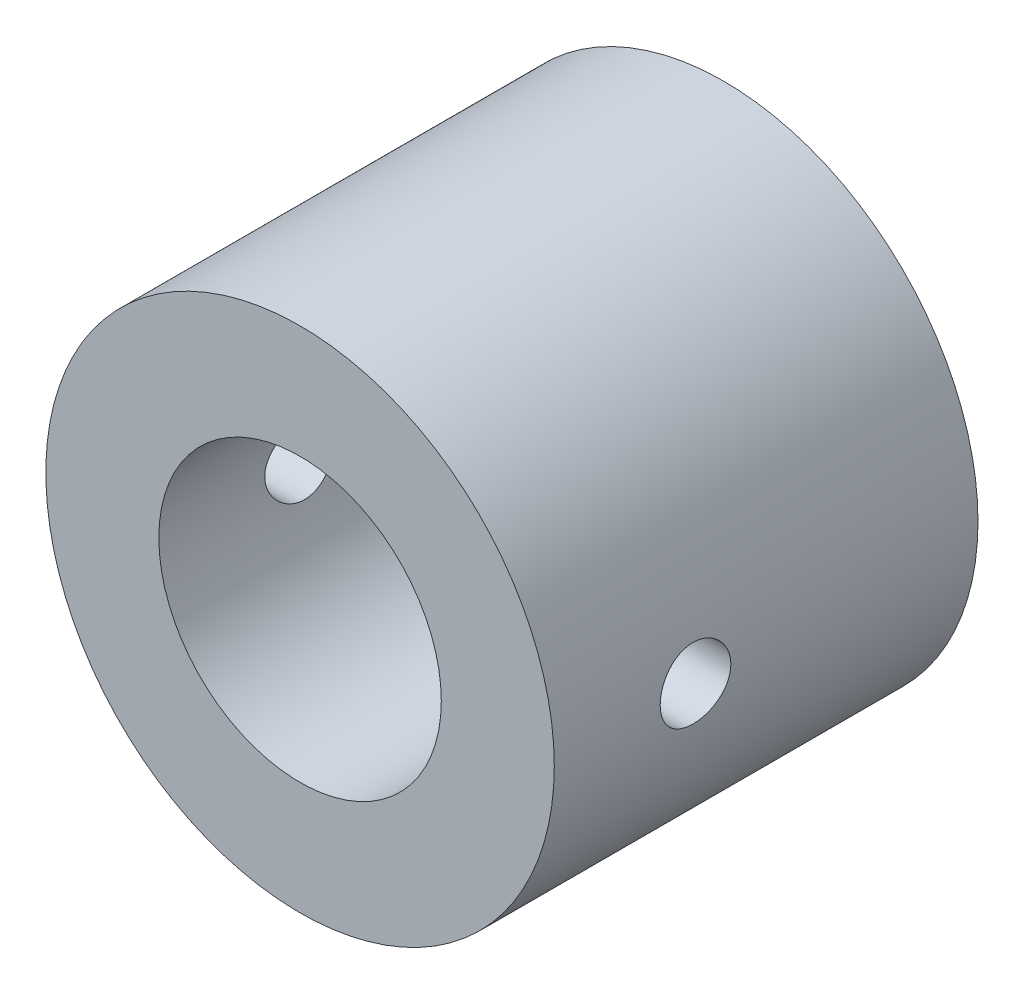
ISO-10303-21;
HEADER;
FILE_DESCRIPTION(('STEP AP214'),'2;1');
FILE_NAME('part.step','',(''),(''),'','','');
FILE_SCHEMA(('AUTOMOTIVE_DESIGN { 1 0 10303 214 1 1 1 1 }'));
ENDSEC;
DATA;
#1=APPLICATION_CONTEXT('core data for automotive mechanical design processes');
#2=APPLICATION_PROTOCOL_DEFINITION('international standard','automotive_design',2000,#1);
#3=PRODUCT_CONTEXT('',#1,'mechanical');
#4=PRODUCT('Part','Part','',(#3));
#5=PRODUCT_RELATED_PRODUCT_CATEGORY('part','',(#4));
#6=PRODUCT_DEFINITION_FORMATION('','',#4);
#7=PRODUCT_DEFINITION_CONTEXT('part definition',#1,'design');
#8=PRODUCT_DEFINITION('design','',#6,#7);
#9=PRODUCT_DEFINITION_SHAPE('','',#8);
#10=(LENGTH_UNIT() NAMED_UNIT(*) SI_UNIT(.MILLI.,.METRE.));
#11=(NAMED_UNIT(*) PLANE_ANGLE_UNIT() SI_UNIT($,.RADIAN.));
#12=(NAMED_UNIT(*) SI_UNIT($,.STERADIAN.) SOLID_ANGLE_UNIT());
#13=UNCERTAINTY_MEASURE_WITH_UNIT(LENGTH_MEASURE(1.E-05),#10,'distance_accuracy_value','');
#14=(GEOMETRIC_REPRESENTATION_CONTEXT(3) GLOBAL_UNCERTAINTY_ASSIGNED_CONTEXT((#13)) GLOBAL_UNIT_ASSIGNED_CONTEXT((#10,
#11,#12)) REPRESENTATION_CONTEXT('',''));
#15=CARTESIAN_POINT('',(0.,0.,0.));
#16=DIRECTION('',(0.,0.,1.));
#17=DIRECTION('',(1.,0.,0.));
#18=AXIS2_PLACEMENT_3D('',#15,#16,#17);
#19=CARTESIAN_POINT('',(0.,0.,15.));
#20=DIRECTION('',(0.,0.,-1.));
#21=DIRECTION('',(-1.,0.,0.));
#22=AXIS2_PLACEMENT_3D('',#19,#20,#21);
#23=CYLINDRICAL_SURFACE('',#22,5.);
#24=CARTESIAN_POINT('',(0.,0.,15.));
#25=DIRECTION('',(0.,0.,1.));
#26=DIRECTION('',(1.,0.,0.));
#27=AXIS2_PLACEMENT_3D('',#24,#25,#26);
#28=CIRCLE('',#27,5.);
#29=CARTESIAN_POINT('',(5.,0.,15.));
#30=VERTEX_POINT('',#29);
#31=EDGE_CURVE('E47',#30,#30,#28,.T.);
#32=ORIENTED_EDGE('',*,*,#31,.T.);
#33=EDGE_LOOP('',(#32));
#34=FACE_BOUND('',#33,.T.);
#35=CARTESIAN_POINT('',(5.,0.,8.75));
#36=CARTESIAN_POINT('',(4.99999883223344,-0.0690634072247758,8.75000193811513));
#37=CARTESIAN_POINT('',(4.99855481776523,-0.138148464858969,8.75574295897816));
#38=CARTESIAN_POINT('',(4.99293428191577,-0.27433860314211,8.7785209594225));
#39=CARTESIAN_POINT('',(4.98875621183307,-0.341442539058949,8.79556434128154));
#40=CARTESIAN_POINT('',(4.97813021943366,-0.471684060152147,8.84036604455174));
#41=CARTESIAN_POINT('',(4.97168502368406,-0.534826302858335,8.8681114989294));
#42=CARTESIAN_POINT('',(4.95721119839661,-0.655560109920355,8.93348449170403));
#43=CARTESIAN_POINT('',(4.94918251545042,-0.713151486957298,8.97111236343245));
#44=CARTESIAN_POINT('',(4.93222844659834,-0.822334939417432,9.05600065804517));
#45=CARTESIAN_POINT('',(4.92328922623777,-0.873796408384226,9.10342631246598));
#46=CARTESIAN_POINT('',(4.90561350097941,-0.968124106002753,9.20621017075743));
#47=CARTESIAN_POINT('',(4.89687701906957,-1.01098936412428,9.26156926912208));
#48=CARTESIAN_POINT('',(4.88045646416425,-1.08752211899919,9.37966268894786));
#49=CARTESIAN_POINT('',(4.87278995392171,-1.12104351327113,9.44249435900867));
#50=CARTESIAN_POINT('',(4.85957912343519,-1.17699742379211,9.57312367638197));
#51=CARTESIAN_POINT('',(4.85403446393991,-1.19943171286611,9.64092052777147));
#52=CARTESIAN_POINT('',(4.84583730597959,-1.23212903067024,9.77811958183539));
#53=CARTESIAN_POINT('',(4.84312909229522,-1.24262689027778,9.84746241337483));
#54=CARTESIAN_POINT('',(4.84074468781451,-1.25188481255654,9.98697380751165));
#55=CARTESIAN_POINT('',(4.8410680037387,-1.25064678484831,10.0571422339155));
#56=CARTESIAN_POINT('',(4.84466004580515,-1.2366554371994,10.1945131731204));
#57=CARTESIAN_POINT('',(4.84785719168233,-1.22418195015877,10.2617463512209));
#58=CARTESIAN_POINT('',(4.85672258063736,-1.18852015575259,10.3931342090927));
#59=CARTESIAN_POINT('',(4.8623909997558,-1.16533108505785,10.4572886691908));
#60=CARTESIAN_POINT('',(4.87562594920155,-1.10865789828096,10.5814483468767));
#61=CARTESIAN_POINT('',(4.88321106224518,-1.07507222269409,10.641405143158));
#62=CARTESIAN_POINT('',(4.89941425705322,-0.998630230012462,10.7549322581307));
#63=CARTESIAN_POINT('',(4.90803251945613,-0.955772290674033,10.8085014567227));
#64=CARTESIAN_POINT('',(4.92563233783151,-0.860552853901015,10.909336346412));
#65=CARTESIAN_POINT('',(4.93461724564976,-0.807955215138216,10.9563787417178));
#66=CARTESIAN_POINT('',(4.95171637982321,-0.695509931253082,11.0410177020533));
#67=CARTESIAN_POINT('',(4.95983057957846,-0.635662064756619,11.078613978553));
#68=CARTESIAN_POINT('',(4.97431443411819,-0.510096573901159,11.1433754885203));
#69=CARTESIAN_POINT('',(4.98067800106437,-0.444359494340519,11.170504450212));
#70=CARTESIAN_POINT('',(4.99089930826182,-0.309063340119069,11.2132644214246));
#71=CARTESIAN_POINT('',(4.99475752782734,-0.239504999292071,11.2288976303484));
#72=CARTESIAN_POINT('',(4.99946249392812,-0.100449975325023,11.2478813046324));
#73=CARTESIAN_POINT('',(5.00038377923565,-0.0309972666568417,11.2515358550627));
#74=CARTESIAN_POINT('',(4.99932337345376,0.107527395667923,11.2472924982871));
#75=CARTESIAN_POINT('',(4.99734194368205,0.176599383037162,11.2393956310007));
#76=CARTESIAN_POINT('',(4.99074650939464,0.311345223980409,11.2125242430072));
#77=CARTESIAN_POINT('',(4.98617195154843,0.377054265807295,11.1937156137692));
#78=CARTESIAN_POINT('',(4.97490588861778,0.504381077043759,11.145744096643));
#79=CARTESIAN_POINT('',(4.9682141697491,0.565998432527195,11.1165801630724));
#80=CARTESIAN_POINT('',(4.95327756605259,0.684602612024872,11.0481365592711));
#81=CARTESIAN_POINT('',(4.94500722805777,0.741487868196524,11.0086865730027));
#82=CARTESIAN_POINT('',(4.92787090989516,0.847938844702704,10.9210084093359));
#83=CARTESIAN_POINT('',(4.91900482709754,0.897503299144172,10.8727787169859));
#84=CARTESIAN_POINT('',(4.90140797467309,0.989158806727274,10.7674983659629));
#85=CARTESIAN_POINT('',(4.89268586822734,1.03103655635169,10.710260247498));
#86=CARTESIAN_POINT('',(4.87660731981032,1.10459229917725,10.5893894712786));
#87=CARTESIAN_POINT('',(4.86925081722522,1.13627074513161,10.5257570975335));
#88=CARTESIAN_POINT('',(4.85681745612221,1.18829285050774,10.3942452313224));
#89=CARTESIAN_POINT('',(4.85172712743255,1.20870366387839,10.3263936430467));
#90=CARTESIAN_POINT('',(4.84438953408486,1.23778804996148,10.1880753017591));
#91=CARTESIAN_POINT('',(4.84214164766613,1.24646418956555,10.1176091241396));
#92=CARTESIAN_POINT('',(4.84079084336631,1.25169882527833,9.97823248012066));
#93=CARTESIAN_POINT('',(4.8415994394022,1.2485982481501,9.90933547072939));
#94=CARTESIAN_POINT('',(4.84606590839869,1.23114773192739,9.77308009277668));
#95=CARTESIAN_POINT('',(4.84972372409881,1.21679801890564,9.70572169332196));
#96=CARTESIAN_POINT('',(4.85942717235602,1.17744276620233,9.57482628411216));
#97=CARTESIAN_POINT('',(4.86545846030258,1.15250117056698,9.51126891229982));
#98=CARTESIAN_POINT('',(4.87923129770691,1.09272076133756,9.38919551440526));
#99=CARTESIAN_POINT('',(4.88697308433977,1.05788057502849,9.3306801890109));
#100=CARTESIAN_POINT('',(4.90354695219593,0.97822312386428,9.21870447583165));
#101=CARTESIAN_POINT('',(4.91240220693131,0.933169302426878,9.1654157721467));
#102=CARTESIAN_POINT('',(4.93006689371905,0.834824475991445,9.06704412933716));
#103=CARTESIAN_POINT('',(4.93887631439216,0.781531517717621,9.02196314157253));
#104=CARTESIAN_POINT('',(4.95564713039719,0.667056322252158,8.94049057619616));
#105=CARTESIAN_POINT('',(4.9635902780489,0.605748685263655,8.90427115527369));
#106=CARTESIAN_POINT('',(4.97754104145932,0.47772171625873,8.84271044754956));
#107=CARTESIAN_POINT('',(4.98355004333151,0.411006302863949,8.81736136612622));
#108=CARTESIAN_POINT('',(4.99206716304618,0.287008544369559,8.78202347472529));
#109=CARTESIAN_POINT('',(4.99502154210576,0.230316809090057,8.7700406307888));
#110=CARTESIAN_POINT('',(4.9989883769329,0.115755059613569,8.75402838031505));
#111=CARTESIAN_POINT('',(5.00000097875745,0.0578851343688469,8.74999837557892));
#112=CARTESIAN_POINT('',(5.,0.,8.75));
#113=B_SPLINE_CURVE_WITH_KNOTS('',3,(#35,#36,#37,#38,#39,#40,#41,#42,#43,#44,#45,#46,#47,#48,
#49,#50,#51,#52,#53,#54,#55,#56,#57,#58,#59,#60,#61,#62,#63,#64,#65,#66,#67,#68,#69,#70,#71,#72,
#73,#74,#75,#76,#77,#78,#79,#80,#81,#82,#83,#84,#85,#86,#87,#88,#89,#90,#91,#92,#93,#94,#95,#96,
#97,#98,#99,#100,#101,#102,#103,#104,#105,#106,#107,#108,#109,#110,#111,#112),.UNSPECIFIED.,.T.,
.F.,(4,2,2,2,2,2,2,2,2,2,2,2,2,2,2,2,2,2,2,2,2,2,2,2,2,2,2,2,2,2,2,2,2,2,2,2,2,2,4),(0.,
0.206978093726574,0.414073531469916,0.620920751905087,0.827774950141106,1.03845362864282,
1.24915607983385,1.46298872954839,1.6767871764114,1.88630245916192,2.09578365093914,
2.30018747505848,2.50460586221698,2.71108773228232,2.91760575696802,3.13001250807516,
3.34242574631872,3.55556857507595,3.76867061407202,3.97631924124396,4.18394917593952,
4.38850228761697,4.59307606101908,4.80127989637793,5.00951969173349,5.22287091003729,
5.4362126562459,5.6482687884503,5.86027852710339,6.06619816998843,6.27211367463362,
6.47680333799539,6.68152140114084,6.89157980341591,7.10168808142014,7.31560154582989,
7.52936136517791,7.7028520245179,7.87632963369199),.UNSPECIFIED.);
#114=CARTESIAN_POINT('',(5.,0.,8.75));
#115=VERTEX_POINT('',#114);
#116=EDGE_CURVE('E52',#115,#115,#113,.T.);
#117=ORIENTED_EDGE('',*,*,#116,.F.);
#118=EDGE_LOOP('',(#117));
#119=FACE_BOUND('',#118,.T.);
#120=CARTESIAN_POINT('',(-5.,0.,11.25));
#121=CARTESIAN_POINT('',(-4.99999883223344,-0.0690634072247752,11.2499980618849));
#122=CARTESIAN_POINT('',(-4.99855481776524,-0.138148464858968,11.2442570410218));
#123=CARTESIAN_POINT('',(-4.99293428191577,-0.274338603142108,11.2214790405775));
#124=CARTESIAN_POINT('',(-4.98875621183307,-0.341442539058946,11.2044356587184));
#125=CARTESIAN_POINT('',(-4.97813021943366,-0.471684060152143,11.1596339554482));
#126=CARTESIAN_POINT('',(-4.97168502368406,-0.534826302858331,11.1318885010706));
#127=CARTESIAN_POINT('',(-4.95721119839661,-0.655560109920349,11.066515508296));
#128=CARTESIAN_POINT('',(-4.94918251545042,-0.713151486957293,11.0288876365675));
#129=CARTESIAN_POINT('',(-4.93222844659835,-0.822334939417425,10.9439993419548));
#130=CARTESIAN_POINT('',(-4.92328922623778,-0.873796408384218,10.896573687534));
#131=CARTESIAN_POINT('',(-4.90561350097941,-0.968124106002744,10.7937898292426));
#132=CARTESIAN_POINT('',(-4.89687701906957,-1.01098936412427,10.7384307308779));
#133=CARTESIAN_POINT('',(-4.88045646416426,-1.08752211899918,10.6203373110521));
#134=CARTESIAN_POINT('',(-4.87278995392171,-1.12104351327112,10.5575056409913));
#135=CARTESIAN_POINT('',(-4.8595791234352,-1.1769974237921,10.426876323618));
#136=CARTESIAN_POINT('',(-4.85403446393991,-1.1994317128661,10.3590794722285));
#137=CARTESIAN_POINT('',(-4.84583730597959,-1.23212903067023,10.2218804181646));
#138=CARTESIAN_POINT('',(-4.84312909229522,-1.24262689027777,10.1525375866252));
#139=CARTESIAN_POINT('',(-4.84074468781451,-1.25188481255653,10.0130261924883));
#140=CARTESIAN_POINT('',(-4.8410680037387,-1.2506467848483,9.94285776608449));
#141=CARTESIAN_POINT('',(-4.84466004580515,-1.23665543719939,9.8054868268796));
#142=CARTESIAN_POINT('',(-4.84785719168233,-1.22418195015875,9.73825364877909));
#143=CARTESIAN_POINT('',(-4.85672258063737,-1.18852015575258,9.60686579090726));
#144=CARTESIAN_POINT('',(-4.86239099975581,-1.16533108505784,9.54271133080918));
#145=CARTESIAN_POINT('',(-4.87562594920156,-1.10865789828095,9.41855165312328));
#146=CARTESIAN_POINT('',(-4.88321106224518,-1.07507222269408,9.35859485684204));
#147=CARTESIAN_POINT('',(-4.89941425705322,-0.998630230012451,9.24506774186931));
#148=CARTESIAN_POINT('',(-4.90803251945613,-0.955772290674022,9.19149854327729));
#149=CARTESIAN_POINT('',(-4.92563233783151,-0.860552853901006,9.09066365358801));
#150=CARTESIAN_POINT('',(-4.93461724564976,-0.807955215138208,9.04362125828222));
#151=CARTESIAN_POINT('',(-4.95171637982322,-0.695509931253076,8.95898229794675));
#152=CARTESIAN_POINT('',(-4.95983057957846,-0.635662064756613,8.92138602144704));
#153=CARTESIAN_POINT('',(-4.97431443411819,-0.510096573901154,8.85662451147969));
#154=CARTESIAN_POINT('',(-4.98067800106438,-0.444359494340515,8.82949554978799));
#155=CARTESIAN_POINT('',(-4.99089930826182,-0.309063340119066,8.78673557857537));
#156=CARTESIAN_POINT('',(-4.99475752782734,-0.239504999292068,8.77110236965156));
#157=CARTESIAN_POINT('',(-4.99946249392812,-0.100449975325021,8.75211869536765));
#158=CARTESIAN_POINT('',(-5.00038377923565,-0.0309972666568406,8.74846414493726));
#159=CARTESIAN_POINT('',(-4.99932337345376,0.107527395667923,8.75270750171292));
#160=CARTESIAN_POINT('',(-4.99734194368205,0.176599383037161,8.76060436899929));
#161=CARTESIAN_POINT('',(-4.99074650939464,0.311345223980408,8.78747575699283));
#162=CARTESIAN_POINT('',(-4.98617195154843,0.377054265807293,8.80628438623083));
#163=CARTESIAN_POINT('',(-4.97490588861778,0.504381077043756,8.85425590335705));
#164=CARTESIAN_POINT('',(-4.9682141697491,0.565998432527191,8.88341983692765));
#165=CARTESIAN_POINT('',(-4.95327756605259,0.684602612024867,8.95186344072895));
#166=CARTESIAN_POINT('',(-4.94500722805777,0.741487868196519,8.99131342699731));
#167=CARTESIAN_POINT('',(-4.92787090989516,0.847938844702698,9.07899159066415));
#168=CARTESIAN_POINT('',(-4.91900482709754,0.897503299144165,9.1272212830141));
#169=CARTESIAN_POINT('',(-4.90140797467309,0.989158806727266,9.23250163403706));
#170=CARTESIAN_POINT('',(-4.89268586822734,1.03103655635168,9.28973975250202));
#171=CARTESIAN_POINT('',(-4.87660731981032,1.10459229917724,9.41061052872144));
#172=CARTESIAN_POINT('',(-4.86925081722522,1.1362707451316,9.47424290246646));
#173=CARTESIAN_POINT('',(-4.85681745612221,1.18829285050773,9.60575476867757));
#174=CARTESIAN_POINT('',(-4.85172712743255,1.20870366387838,9.67360635695334));
#175=CARTESIAN_POINT('',(-4.84438953408486,1.23778804996147,9.81192469824093));
#176=CARTESIAN_POINT('',(-4.84214164766614,1.24646418956554,9.88239087586041));
#177=CARTESIAN_POINT('',(-4.84079084336631,1.25169882527832,10.0217675198793));
#178=CARTESIAN_POINT('',(-4.8415994394022,1.24859824815009,10.0906645292706));
#179=CARTESIAN_POINT('',(-4.84606590839869,1.23114773192738,10.2269199072233));
#180=CARTESIAN_POINT('',(-4.84972372409881,1.21679801890563,10.294278306678));
#181=CARTESIAN_POINT('',(-4.85942717235602,1.17744276620232,10.4251737158878));
#182=CARTESIAN_POINT('',(-4.86545846030258,1.15250117056697,10.4887310877002));
#183=CARTESIAN_POINT('',(-4.87923129770691,1.09272076133755,10.6108044855947));
#184=CARTESIAN_POINT('',(-4.88697308433978,1.05788057502848,10.6693198109891));
#185=CARTESIAN_POINT('',(-4.90354695219594,0.978223123864269,10.7812955241683));
#186=CARTESIAN_POINT('',(-4.91240220693131,0.933169302426868,10.8345842278533));
#187=CARTESIAN_POINT('',(-4.93006689371905,0.834824475991436,10.9329558706628));
#188=CARTESIAN_POINT('',(-4.93887631439217,0.781531517717612,10.9780368584275));
#189=CARTESIAN_POINT('',(-4.95564713039719,0.667056322252149,11.0595094238038));
#190=CARTESIAN_POINT('',(-4.9635902780489,0.605748685263647,11.0957288447263));
#191=CARTESIAN_POINT('',(-4.97754104145932,0.477721716258723,11.1572895524504));
#192=CARTESIAN_POINT('',(-4.98355004333151,0.411006302863943,11.1826386338738));
#193=CARTESIAN_POINT('',(-4.99206716304618,0.287008544369555,11.2179765252747));
#194=CARTESIAN_POINT('',(-4.99502154210576,0.230316809090053,11.2299593692112));
#195=CARTESIAN_POINT('',(-4.9989883769329,0.115755059613567,11.2459716196849));
#196=CARTESIAN_POINT('',(-5.00000097875745,0.057885134368846,11.2500016244211));
#197=CARTESIAN_POINT('',(-5.,0.,11.25));
#198=B_SPLINE_CURVE_WITH_KNOTS('',3,(#120,#121,#122,#123,#124,#125,#126,#127,#128,#129,#130,
#131,#132,#133,#134,#135,#136,#137,#138,#139,#140,#141,#142,#143,#144,#145,#146,#147,#148,#149,
#150,#151,#152,#153,#154,#155,#156,#157,#158,#159,#160,#161,#162,#163,#164,#165,#166,#167,#168,
#169,#170,#171,#172,#173,#174,#175,#176,#177,#178,#179,#180,#181,#182,#183,#184,#185,#186,#187,
#188,#189,#190,#191,#192,#193,#194,#195,#196,#197),.UNSPECIFIED.,.T.,.F.,(4,2,2,2,2,2,2,2,2,2,2,
2,2,2,2,2,2,2,2,2,2,2,2,2,2,2,2,2,2,2,2,2,2,2,2,2,2,2,4),(0.,0.206978093726573,
0.414073531469913,0.620920751905083,0.827774950141099,1.03845362864281,1.24915607983384,
1.46298872954838,1.67678717641139,1.8863024591619,2.09578365093912,2.30018747505846,
2.50460586221696,2.7110877322823,2.91760575696799,3.13001250807513,3.34242574631869,
3.55556857507591,3.76867061407198,3.97631924124393,4.18394917593948,4.38850228761693,
4.59307606101904,4.80127989637789,5.00951969173344,5.22287091003725,5.43621265624585,
5.64826878845025,5.86027852710334,6.06619816998838,6.27211367463356,6.47680333799533,
6.68152140114077,6.89157980341585,7.10168808142008,7.31560154582983,7.52936136517784,
7.70285202451783,7.87632963369192),.UNSPECIFIED.);
#199=CARTESIAN_POINT('',(-5.,0.,11.25));
#200=VERTEX_POINT('',#199);
#201=EDGE_CURVE('E60',#200,#200,#198,.T.);
#202=ORIENTED_EDGE('',*,*,#201,.F.);
#203=EDGE_LOOP('',(#202));
#204=FACE_BOUND('',#203,.T.);
#205=CARTESIAN_POINT('',(0.,0.,1.));
#206=DIRECTION('',(0.,0.,-1.));
#207=DIRECTION('',(-1.,0.,0.));
#208=AXIS2_PLACEMENT_3D('',#205,#206,#207);
#209=CIRCLE('',#208,5.);
#210=CARTESIAN_POINT('',(-5.,0.,1.));
#211=VERTEX_POINT('',#210);
#212=EDGE_CURVE('E38',#211,#211,#209,.T.);
#213=ORIENTED_EDGE('',*,*,#212,.T.);
#214=EDGE_LOOP('',(#213));
#215=FACE_BOUND('',#214,.T.);
#216=ADVANCED_FACE('F33',(#34,#119,#204,#215),#23,.F.);
#217=CARTESIAN_POINT('',(0.,0.,15.));
#218=DIRECTION('',(0.,0.,1.));
#219=DIRECTION('',(1.,0.,0.));
#220=AXIS2_PLACEMENT_3D('',#217,#218,#219);
#221=PLANE('',#220);
#222=CARTESIAN_POINT('',(0.,0.,15.));
#223=DIRECTION('',(0.,0.,1.));
#224=DIRECTION('',(1.,0.,0.));
#225=AXIS2_PLACEMENT_3D('',#222,#223,#224);
#226=CIRCLE('',#225,9.);
#227=CARTESIAN_POINT('',(9.,0.,15.));
#228=VERTEX_POINT('',#227);
#229=EDGE_CURVE('E10',#228,#228,#226,.T.);
#230=ORIENTED_EDGE('',*,*,#229,.T.);
#231=EDGE_LOOP('',(#230));
#232=FACE_BOUND('',#231,.T.);
#233=ORIENTED_EDGE('',*,*,#31,.F.);
#234=EDGE_LOOP('',(#233));
#235=FACE_BOUND('',#234,.T.);
#236=ADVANCED_FACE('F98',(#232,#235),#221,.T.);
#237=CARTESIAN_POINT('',(0.,0.,0.));
#238=DIRECTION('',(0.,0.,1.));
#239=DIRECTION('',(1.,0.,0.));
#240=AXIS2_PLACEMENT_3D('',#237,#238,#239);
#241=PLANE('',#240);
#242=CARTESIAN_POINT('',(0.,0.,0.));
#243=DIRECTION('',(0.,0.,-1.));
#244=DIRECTION('',(-1.,0.,0.));
#245=AXIS2_PLACEMENT_3D('',#242,#243,#244);
#246=CIRCLE('',#245,8.1);
#247=CARTESIAN_POINT('',(-8.1,0.,0.));
#248=VERTEX_POINT('',#247);
#249=EDGE_CURVE('E82',#248,#248,#246,.T.);
#250=ORIENTED_EDGE('',*,*,#249,.F.);
#251=EDGE_LOOP('',(#250));
#252=FACE_BOUND('',#251,.T.);
#253=CARTESIAN_POINT('',(0.,0.,0.));
#254=DIRECTION('',(0.,0.,1.));
#255=DIRECTION('',(1.,0.,0.));
#256=AXIS2_PLACEMENT_3D('',#253,#254,#255);
#257=CIRCLE('',#256,9.);
#258=CARTESIAN_POINT('',(9.,0.,0.));
#259=VERTEX_POINT('',#258);
#260=EDGE_CURVE('E42',#259,#259,#257,.T.);
#261=ORIENTED_EDGE('',*,*,#260,.F.);
#262=EDGE_LOOP('',(#261));
#263=FACE_BOUND('',#262,.T.);
#264=ADVANCED_FACE('F103',(#252,#263),#241,.F.);
#265=CARTESIAN_POINT('',(0.,0.,15.));
#266=DIRECTION('',(0.,0.,-1.));
#267=DIRECTION('',(-1.,0.,0.));
#268=AXIS2_PLACEMENT_3D('',#265,#266,#267);
#269=CYLINDRICAL_SURFACE('',#268,9.);
#270=CARTESIAN_POINT('',(-9.,0.,11.25));
#271=CARTESIAN_POINT('',(-8.99999894112753,-0.0698524432674786,11.2499970764134));
#272=CARTESIAN_POINT('',(-8.99917821909749,-0.139746876410524,11.2441250072102));
#273=CARTESIAN_POINT('',(-8.99598316286198,-0.277586159937054,11.2207955090503));
#274=CARTESIAN_POINT('',(-8.99360726484072,-0.345528975998048,11.2033264183935));
#275=CARTESIAN_POINT('',(-8.98756916249447,-0.47744993605439,11.1573314803886));
#276=CARTESIAN_POINT('',(-8.98390788118544,-0.541430886330458,11.1288135655305));
#277=CARTESIAN_POINT('',(-8.97570481006727,-0.663688186066632,11.0615489663612));
#278=CARTESIAN_POINT('',(-8.97116315591379,-0.721965412327882,11.0228038576146));
#279=CARTESIAN_POINT('',(-8.96167110812553,-0.831564576835302,10.9359061120719));
#280=CARTESIAN_POINT('',(-8.95671841784774,-0.882842518790508,10.8876982303701));
#281=CARTESIAN_POINT('',(-8.94698072235377,-0.976608234008458,10.7833621808506));
#282=CARTESIAN_POINT('',(-8.94219572626412,-1.01909552946634,10.7272335827909));
#283=CARTESIAN_POINT('',(-8.93331280195876,-1.09424186139763,10.6083581044657));
#284=CARTESIAN_POINT('',(-8.92921783911827,-1.12685893577152,10.5455844573968));
#285=CARTESIAN_POINT('',(-8.9222095544648,-1.18107087638652,10.4153837950484));
#286=CARTESIAN_POINT('',(-8.91929617746777,-1.20266625739017,10.347956997259));
#287=CARTESIAN_POINT('',(-8.91500325152303,-1.23408646989724,10.2108241341288));
#288=CARTESIAN_POINT('',(-8.91361394942638,-1.24398617833558,10.141135535551));
#289=CARTESIAN_POINT('',(-8.91249677033615,-1.25196586814037,10.0010734013625));
#290=CARTESIAN_POINT('',(-8.91276881133565,-1.25004643292128,9.93069989973122));
#291=CARTESIAN_POINT('',(-8.91493465758728,-1.23450363802968,9.79179120897347));
#292=CARTESIAN_POINT('',(-8.91681696642587,-1.22096324330854,9.72324653180948));
#293=CARTESIAN_POINT('',(-8.92197331658116,-1.1826925653599,9.58941166568422));
#294=CARTESIAN_POINT('',(-8.92524739209301,-1.15796200719352,9.52412155673045));
#295=CARTESIAN_POINT('',(-8.93283122971518,-1.09792538280572,9.39839427134722));
#296=CARTESIAN_POINT('',(-8.93714446505613,-1.06258375105994,9.33797429604759));
#297=CARTESIAN_POINT('',(-8.94631804418278,-0.982353578958044,9.22389103836506));
#298=CARTESIAN_POINT('',(-8.95117841880646,-0.937464500359804,9.17022813718729));
#299=CARTESIAN_POINT('',(-8.96094958209835,-0.838956215124461,9.070701144593));
#300=CARTESIAN_POINT('',(-8.96586044627415,-0.785265592189323,9.0249077163315));
#301=CARTESIAN_POINT('',(-8.97514050674014,-0.67092285916727,8.94297142256396));
#302=CARTESIAN_POINT('',(-8.97950970122931,-0.61027072593499,8.90682858914517));
#303=CARTESIAN_POINT('',(-8.98721779212188,-0.483668566732566,8.84521749124962));
#304=CARTESIAN_POINT('',(-8.9905562084133,-0.417716089958327,8.81975419907647));
#305=CARTESIAN_POINT('',(-8.99582244302653,-0.282414617975585,8.78028392791703));
#306=CARTESIAN_POINT('',(-8.99775034299601,-0.213065819610989,8.76627628581538));
#307=CARTESIAN_POINT('',(-8.99996760516492,-0.0735506507379409,8.75020779285972));
#308=CARTESIAN_POINT('',(-9.00027030327137,-0.00339568328222966,8.74804970487465));
#309=CARTESIAN_POINT('',(-8.99923922007977,0.136275022553968,8.75548417654773));
#310=CARTESIAN_POINT('',(-8.99790548202965,0.20579077777871,8.76507642566667));
#311=CARTESIAN_POINT('',(-8.99375965195284,0.341918779308757,8.79565845560325));
#312=CARTESIAN_POINT('',(-8.99095364519698,0.408541763946673,8.81660133297072));
#313=CARTESIAN_POINT('',(-8.98417711217329,0.537330456139083,8.86924099234227));
#314=CARTESIAN_POINT('',(-8.98020653811879,0.599495980656532,8.90093821564694));
#315=CARTESIAN_POINT('',(-8.97150954082181,0.71803581049977,8.97441824451339));
#316=CARTESIAN_POINT('',(-8.96677851553782,0.77437118443805,9.01626330076601));
#317=CARTESIAN_POINT('',(-8.95710284930006,0.879254172768973,9.10876385195142));
#318=CARTESIAN_POINT('',(-8.95215819779385,0.9278014018933,9.1594197824873));
#319=CARTESIAN_POINT('',(-8.94257081023239,1.01607974304114,9.26853494672837));
#320=CARTESIAN_POINT('',(-8.93793045954482,1.05574600476846,9.32704688764328));
#321=CARTESIAN_POINT('',(-8.92951793446703,1.12468695508688,9.44996001851086));
#322=CARTESIAN_POINT('',(-8.92574573934466,1.15396189183903,9.51436106777626));
#323=CARTESIAN_POINT('',(-8.91951345452543,1.20118657145912,9.64702354578474));
#324=CARTESIAN_POINT('',(-8.91704928346968,1.21917157417325,9.71527222279974));
#325=CARTESIAN_POINT('',(-8.91370081228886,1.24341873550688,9.85385776577743));
#326=CARTESIAN_POINT('',(-8.91281641984846,1.24968157911893,9.92419450947847));
#327=CARTESIAN_POINT('',(-8.91273074448822,1.25029208082017,10.06431381146));
#328=CARTESIAN_POINT('',(-8.91351506465158,1.24474165841306,10.1340959385059));
#329=CARTESIAN_POINT('',(-8.91664731052215,1.22210038835405,10.2717246084147));
#330=CARTESIAN_POINT('',(-8.91899523506783,1.20500954927504,10.3395711527156));
#331=CARTESIAN_POINT('',(-8.92498537468198,1.15980672337379,10.4713813721868));
#332=CARTESIAN_POINT('',(-8.92862687318733,1.13170083734508,10.5353471741365));
#333=CARTESIAN_POINT('',(-8.93679486162302,1.06527577701552,10.6576715834595));
#334=CARTESIAN_POINT('',(-8.94132137280736,1.02695635742405,10.71603005612));
#335=CARTESIAN_POINT('',(-8.95079601194598,0.940817900572809,10.8260026282592));
#336=CARTESIAN_POINT('',(-8.9557473092005,0.892923123926576,10.8775571357939));
#337=CARTESIAN_POINT('',(-8.9654864535163,0.789153098909216,10.9719345729145));
#338=CARTESIAN_POINT('',(-8.97027426208699,0.733275987068032,11.0147554579602));
#339=CARTESIAN_POINT('',(-8.97917230387635,0.614821941864994,11.0906262405455));
#340=CARTESIAN_POINT('',(-8.98327925254998,0.552214803421995,11.1236293504997));
#341=CARTESIAN_POINT('',(-8.99032025416553,0.422321399113682,11.1786041751452));
#342=CARTESIAN_POINT('',(-8.99325554918744,0.355040177626117,11.2005875782822));
#343=CARTESIAN_POINT('',(-8.99693485713489,0.239529012760904,11.227782701193));
#344=CARTESIAN_POINT('',(-8.99807852526027,0.192019668179782,11.2361018139969));
#345=CARTESIAN_POINT('',(-8.9996114581541,0.0963468711203348,11.2472114443362));
#346=CARTESIAN_POINT('',(-9.00000073039825,0.0481834251286104,11.2500020166569));
#347=CARTESIAN_POINT('',(-9.,0.,11.25));
#348=B_SPLINE_CURVE_WITH_KNOTS('',3,(#270,#271,#272,#273,#274,#275,#276,#277,#278,#279,#280,
#281,#282,#283,#284,#285,#286,#287,#288,#289,#290,#291,#292,#293,#294,#295,#296,#297,#298,#299,
#300,#301,#302,#303,#304,#305,#306,#307,#308,#309,#310,#311,#312,#313,#314,#315,#316,#317,#318,
#319,#320,#321,#322,#323,#324,#325,#326,#327,#328,#329,#330,#331,#332,#333,#334,#335,#336,#337,
#338,#339,#340,#341,#342,#343,#344,#345,#346,#347),.UNSPECIFIED.,.T.,.F.,(4,2,2,2,2,2,2,2,2,2,2,
2,2,2,2,2,2,2,2,2,2,2,2,2,2,2,2,2,2,2,2,2,2,2,2,2,2,2,4),(0.,0.209381295059174,
0.418973458745443,0.628415424004139,0.83782514220053,1.04849587520768,1.2591780559589,
1.47074373528115,1.68229953263232,1.89249345858175,2.10267700905925,2.31137237127789,
2.52007286135605,2.72948082119294,2.9389005896398,3.15011234914942,3.3613248109082,
3.57263550251895,3.78393396145109,3.99349589004412,4.20305228043049,4.41174926456976,
4.62045481354829,4.83047455215839,5.04050467694118,5.25202178604045,5.46353384344119,
5.67438199262961,5.88521782037453,6.09424202940499,6.3032660831604,6.51217453009894,
6.72108799468389,6.9317244218219,7.14241010247455,7.35408430824953,7.56553351660852,
7.70996379646383,7.85439264507523),.UNSPECIFIED.);
#349=CARTESIAN_POINT('',(-9.,0.,11.25));
#350=VERTEX_POINT('',#349);
#351=EDGE_CURVE('E59',#350,#350,#348,.T.);
#352=ORIENTED_EDGE('',*,*,#351,.T.);
#353=EDGE_LOOP('',(#352));
#354=FACE_BOUND('',#353,.T.);
#355=CARTESIAN_POINT('',(9.,0.,8.75));
#356=CARTESIAN_POINT('',(8.99999894112753,-0.0698524432674791,8.75000292358656));
#357=CARTESIAN_POINT('',(8.99917821909749,-0.139746876410525,8.75587499278975));
#358=CARTESIAN_POINT('',(8.99598316286198,-0.277586159937056,8.77920449094965));
#359=CARTESIAN_POINT('',(8.99360726484072,-0.345528975998051,8.79667358160647));
#360=CARTESIAN_POINT('',(8.98756916249447,-0.477449936054394,8.84266851961142));
#361=CARTESIAN_POINT('',(8.98390788118544,-0.541430886330462,8.87118643446945));
#362=CARTESIAN_POINT('',(8.97570481006727,-0.663688186066637,8.93845103363876));
#363=CARTESIAN_POINT('',(8.97116315591379,-0.721965412327888,8.9771961423854));
#364=CARTESIAN_POINT('',(8.96167110812553,-0.831564576835309,9.06409388792805));
#365=CARTESIAN_POINT('',(8.95671841784774,-0.882842518790515,9.11230176962994));
#366=CARTESIAN_POINT('',(8.94698072235377,-0.976608234008466,9.21663781914938));
#367=CARTESIAN_POINT('',(8.94219572626413,-1.01909552946635,9.27276641720904));
#368=CARTESIAN_POINT('',(8.93331280195876,-1.09424186139764,9.39164189553432));
#369=CARTESIAN_POINT('',(8.92921783911826,-1.12685893577153,9.4544155426032));
#370=CARTESIAN_POINT('',(8.9222095544648,-1.18107087638653,9.58461620495157));
#371=CARTESIAN_POINT('',(8.91929617746777,-1.20266625739018,9.65204300274104));
#372=CARTESIAN_POINT('',(8.91500325152303,-1.23408646989725,9.7891758658712));
#373=CARTESIAN_POINT('',(8.91361394942638,-1.24398617833559,9.85886446444903));
#374=CARTESIAN_POINT('',(8.91249677033615,-1.25196586814038,9.99892659863746));
#375=CARTESIAN_POINT('',(8.91276881133565,-1.25004643292129,10.0693001002688));
#376=CARTESIAN_POINT('',(8.91493465758728,-1.23450363802969,10.2082087910265));
#377=CARTESIAN_POINT('',(8.91681696642587,-1.22096324330855,10.2767534681905));
#378=CARTESIAN_POINT('',(8.92197331658115,-1.18269256535991,10.4105883343158));
#379=CARTESIAN_POINT('',(8.92524739209301,-1.15796200719353,10.4758784432695));
#380=CARTESIAN_POINT('',(8.93283122971518,-1.09792538280573,10.6016057286528));
#381=CARTESIAN_POINT('',(8.93714446505613,-1.06258375105995,10.6620257039524));
#382=CARTESIAN_POINT('',(8.94631804418278,-0.982353578958053,10.7761089616349));
#383=CARTESIAN_POINT('',(8.95117841880646,-0.937464500359813,10.8297718628127));
#384=CARTESIAN_POINT('',(8.96094958209835,-0.838956215124469,10.929298855407));
#385=CARTESIAN_POINT('',(8.96586044627415,-0.785265592189331,10.9750922836685));
#386=CARTESIAN_POINT('',(8.97514050674014,-0.670922859167277,11.057028577436));
#387=CARTESIAN_POINT('',(8.97950970122931,-0.610270725934997,11.0931714108548));
#388=CARTESIAN_POINT('',(8.98721779212188,-0.483668566732572,11.1547825087504));
#389=CARTESIAN_POINT('',(8.99055620841331,-0.417716089958332,11.1802458009235));
#390=CARTESIAN_POINT('',(8.99582244302653,-0.282414617975588,11.219716072083));
#391=CARTESIAN_POINT('',(8.99775034299601,-0.213065819610992,11.2337237141846));
#392=CARTESIAN_POINT('',(8.99996760516492,-0.0735506507379419,11.2497922071403));
#393=CARTESIAN_POINT('',(9.00027030327137,-0.00339568328222985,11.2519502951254));
#394=CARTESIAN_POINT('',(8.99923922007978,0.136275022553969,11.2445158234523));
#395=CARTESIAN_POINT('',(8.99790548202965,0.205790777778712,11.2349235743333));
#396=CARTESIAN_POINT('',(8.99375965195284,0.34191877930876,11.2043415443968));
#397=CARTESIAN_POINT('',(8.99095364519698,0.408541763946676,11.1833986670293));
#398=CARTESIAN_POINT('',(8.98417711217329,0.537330456139088,11.1307590076577));
#399=CARTESIAN_POINT('',(8.98020653811879,0.599495980656537,11.0990617843531));
#400=CARTESIAN_POINT('',(8.97150954082181,0.718035810499776,11.0255817554866));
#401=CARTESIAN_POINT('',(8.96677851553782,0.774371184438057,10.983736699234));
#402=CARTESIAN_POINT('',(8.95710284930006,0.879254172768981,10.8912361480486));
#403=CARTESIAN_POINT('',(8.95215819779385,0.927801401893308,10.8405802175127));
#404=CARTESIAN_POINT('',(8.94257081023239,1.01607974304115,10.7314650532716));
#405=CARTESIAN_POINT('',(8.93793045954482,1.05574600476847,10.6729531123567));
#406=CARTESIAN_POINT('',(8.92951793446703,1.12468695508689,10.5500399814891));
#407=CARTESIAN_POINT('',(8.92574573934466,1.15396189183904,10.4856389322237));
#408=CARTESIAN_POINT('',(8.91951345452543,1.20118657145913,10.3529764542153));
#409=CARTESIAN_POINT('',(8.91704928346968,1.21917157417326,10.2847277772003));
#410=CARTESIAN_POINT('',(8.91370081228886,1.24341873550689,10.1461422342226));
#411=CARTESIAN_POINT('',(8.91281641984846,1.24968157911894,10.0758054905215));
#412=CARTESIAN_POINT('',(8.91273074448822,1.25029208082018,9.93568618853996));
#413=CARTESIAN_POINT('',(8.91351506465158,1.24474165841307,9.86590406149412));
#414=CARTESIAN_POINT('',(8.91664731052215,1.22210038835406,9.72827539158525));
#415=CARTESIAN_POINT('',(8.91899523506783,1.20500954927505,9.6604288472844));
#416=CARTESIAN_POINT('',(8.92498537468198,1.1598067233738,9.52861862781322));
#417=CARTESIAN_POINT('',(8.92862687318732,1.13170083734509,9.4646528258635));
#418=CARTESIAN_POINT('',(8.93679486162302,1.06527577701553,9.3423284165405));
#419=CARTESIAN_POINT('',(8.94132137280736,1.02695635742406,9.28396994387997));
#420=CARTESIAN_POINT('',(8.95079601194598,0.940817900572818,9.17399737174081));
#421=CARTESIAN_POINT('',(8.9557473092005,0.892923123926585,9.12244286420611));
#422=CARTESIAN_POINT('',(8.9654864535163,0.789153098909223,9.02806542708548));
#423=CARTESIAN_POINT('',(8.97027426208699,0.733275987068039,8.98524454203982));
#424=CARTESIAN_POINT('',(8.97917230387635,0.614821941865,8.90937375945448));
#425=CARTESIAN_POINT('',(8.98327925254998,0.552214803422,8.87637064950032));
#426=CARTESIAN_POINT('',(8.99032025416553,0.422321399113687,8.82139582485474));
#427=CARTESIAN_POINT('',(8.99325554918744,0.355040177626121,8.79941242171776));
#428=CARTESIAN_POINT('',(8.99693485713489,0.239529012760906,8.772217298807));
#429=CARTESIAN_POINT('',(8.99807852526027,0.192019668179785,8.76389818600308));
#430=CARTESIAN_POINT('',(8.9996114581541,0.0963468711203359,8.75278855566374));
#431=CARTESIAN_POINT('',(9.00000073039825,0.048183425128611,8.74999798334307));
#432=CARTESIAN_POINT('',(9.,0.,8.75));
#433=B_SPLINE_CURVE_WITH_KNOTS('',3,(#355,#356,#357,#358,#359,#360,#361,#362,#363,#364,#365,
#366,#367,#368,#369,#370,#371,#372,#373,#374,#375,#376,#377,#378,#379,#380,#381,#382,#383,#384,
#385,#386,#387,#388,#389,#390,#391,#392,#393,#394,#395,#396,#397,#398,#399,#400,#401,#402,#403,
#404,#405,#406,#407,#408,#409,#410,#411,#412,#413,#414,#415,#416,#417,#418,#419,#420,#421,#422,
#423,#424,#425,#426,#427,#428,#429,#430,#431,#432),.UNSPECIFIED.,.T.,.F.,(4,2,2,2,2,2,2,2,2,2,2,
2,2,2,2,2,2,2,2,2,2,2,2,2,2,2,2,2,2,2,2,2,2,2,2,2,2,2,4),(0.,0.209381295059175,
0.418973458745447,0.628415424004145,0.837825142200536,1.04849587520769,1.25917805595891,
1.47074373528116,1.68229953263233,1.89249345858176,2.10267700905926,2.31137237127791,
2.52007286135607,2.72948082119297,2.93890058963983,3.15011234914944,3.36132481090823,
3.57263550251898,3.78393396145113,3.99349589004416,4.20305228043052,4.4117492645698,
4.62045481354833,4.83047455215844,5.04050467694123,5.2520217860405,5.46353384344124,
5.67438199262965,5.88521782037458,6.09424202940505,6.30326608316045,6.512174530099,
6.72108799468395,6.93172442182196,7.14241010247461,7.35408430824959,7.56553351660858,
7.7099637964639,7.8543926450753),.UNSPECIFIED.);
#434=CARTESIAN_POINT('',(9.,0.,8.75));
#435=VERTEX_POINT('',#434);
#436=EDGE_CURVE('E58',#435,#435,#433,.T.);
#437=ORIENTED_EDGE('',*,*,#436,.T.);
#438=EDGE_LOOP('',(#437));
#439=FACE_BOUND('',#438,.T.);
#440=ORIENTED_EDGE('',*,*,#229,.F.);
#441=EDGE_LOOP('',(#440));
#442=FACE_BOUND('',#441,.T.);
#443=ORIENTED_EDGE('',*,*,#260,.T.);
#444=EDGE_LOOP('',(#443));
#445=FACE_BOUND('',#444,.T.);
#446=ADVANCED_FACE('F35',(#354,#439,#442,#445),#269,.T.);
#447=CARTESIAN_POINT('',(9.,0.,10.));
#448=DIRECTION('',(1.,0.,0.));
#449=DIRECTION('',(0.,0.,-1.));
#450=AXIS2_PLACEMENT_3D('',#447,#448,#449);
#451=CYLINDRICAL_SURFACE('',#450,1.25);
#452=ORIENTED_EDGE('',*,*,#116,.T.);
#453=EDGE_LOOP('',(#452));
#454=FACE_BOUND('',#453,.T.);
#455=ORIENTED_EDGE('',*,*,#436,.F.);
#456=EDGE_LOOP('',(#455));
#457=FACE_BOUND('',#456,.T.);
#458=ADVANCED_FACE('F66',(#454,#457),#451,.F.);
#459=CARTESIAN_POINT('',(-9.,0.,10.));
#460=DIRECTION('',(-1.,0.,0.));
#461=DIRECTION('',(0.,0.,1.));
#462=AXIS2_PLACEMENT_3D('',#459,#460,#461);
#463=CYLINDRICAL_SURFACE('',#462,1.24999999999999);
#464=ORIENTED_EDGE('',*,*,#201,.T.);
#465=EDGE_LOOP('',(#464));
#466=FACE_BOUND('',#465,.T.);
#467=ORIENTED_EDGE('',*,*,#351,.F.);
#468=EDGE_LOOP('',(#467));
#469=FACE_BOUND('',#468,.T.);
#470=ADVANCED_FACE('F69',(#466,#469),#463,.F.);
#471=CARTESIAN_POINT('',(0.,0.,1.));
#472=DIRECTION('',(0.,0.,-1.));
#473=DIRECTION('',(-1.,0.,0.));
#474=AXIS2_PLACEMENT_3D('',#471,#472,#473);
#475=CYLINDRICAL_SURFACE('',#474,8.1);
#476=CARTESIAN_POINT('',(0.,0.,1.));
#477=DIRECTION('',(0.,0.,-1.));
#478=DIRECTION('',(-1.,0.,0.));
#479=AXIS2_PLACEMENT_3D('',#476,#477,#478);
#480=CIRCLE('',#479,8.1);
#481=CARTESIAN_POINT('',(-8.1,0.,1.));
#482=VERTEX_POINT('',#481);
#483=EDGE_CURVE('E85',#482,#482,#480,.T.);
#484=ORIENTED_EDGE('',*,*,#483,.F.);
#485=EDGE_LOOP('',(#484));
#486=FACE_BOUND('',#485,.T.);
#487=ORIENTED_EDGE('',*,*,#249,.T.);
#488=EDGE_LOOP('',(#487));
#489=FACE_BOUND('',#488,.T.);
#490=ADVANCED_FACE('F123',(#486,#489),#475,.F.);
#491=CARTESIAN_POINT('',(0.,0.,1.));
#492=DIRECTION('',(0.,0.,-1.));
#493=DIRECTION('',(-1.,0.,0.));
#494=AXIS2_PLACEMENT_3D('',#491,#492,#493);
#495=PLANE('',#494);
#496=ORIENTED_EDGE('',*,*,#212,.F.);
#497=EDGE_LOOP('',(#496));
#498=FACE_BOUND('',#497,.T.);
#499=ORIENTED_EDGE('',*,*,#483,.T.);
#500=EDGE_LOOP('',(#499));
#501=FACE_BOUND('',#500,.T.);
#502=ADVANCED_FACE('F125',(#498,#501),#495,.T.);
#503=CLOSED_SHELL('',(#216,#236,#264,#446,#458,#470,#490,#502));
#504=MANIFOLD_SOLID_BREP('B2',#503);
#505=ADVANCED_BREP_SHAPE_REPRESENTATION('',(#18,#504),#14);
#506=SHAPE_DEFINITION_REPRESENTATION(#9,#505);
ENDSEC;
END-ISO-10303-21;
